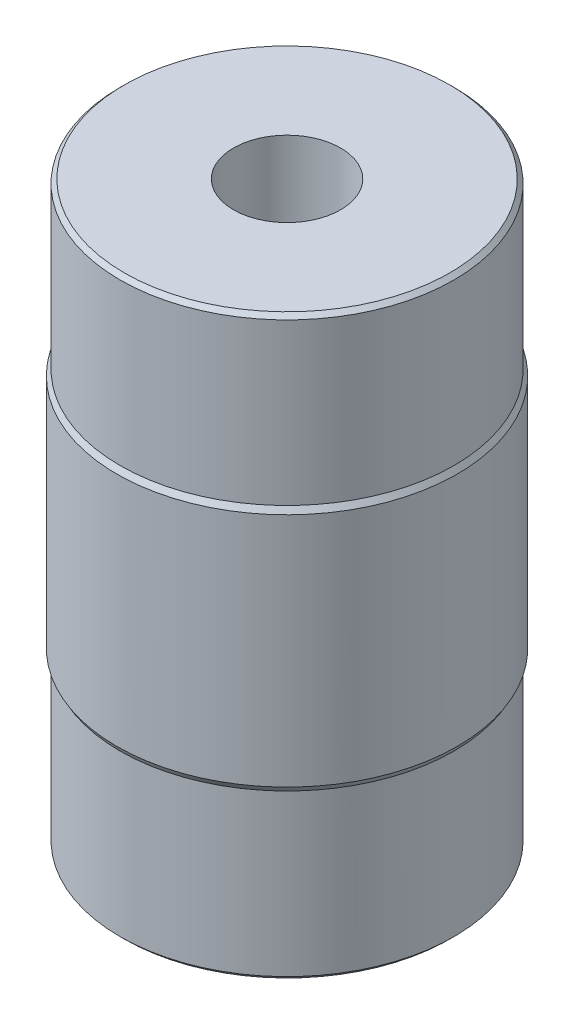
ISO-10303-21;
HEADER;
FILE_DESCRIPTION(('STEP AP214'),'2;1');
FILE_NAME('part.step','',(''),(''),'','','');
FILE_SCHEMA(('AUTOMOTIVE_DESIGN { 1 0 10303 214 1 1 1 1 }'));
ENDSEC;
DATA;
#1=APPLICATION_CONTEXT('core data for automotive mechanical design processes');
#2=APPLICATION_PROTOCOL_DEFINITION('international standard','automotive_design',2000,#1);
#3=PRODUCT_CONTEXT('',#1,'mechanical');
#4=PRODUCT('Part','Part','',(#3));
#5=PRODUCT_RELATED_PRODUCT_CATEGORY('part','',(#4));
#6=PRODUCT_DEFINITION_FORMATION('','',#4);
#7=PRODUCT_DEFINITION_CONTEXT('part definition',#1,'design');
#8=PRODUCT_DEFINITION('design','',#6,#7);
#9=PRODUCT_DEFINITION_SHAPE('','',#8);
#10=(LENGTH_UNIT() NAMED_UNIT(*) SI_UNIT(.MILLI.,.METRE.));
#11=(NAMED_UNIT(*) PLANE_ANGLE_UNIT() SI_UNIT($,.RADIAN.));
#12=(NAMED_UNIT(*) SI_UNIT($,.STERADIAN.) SOLID_ANGLE_UNIT());
#13=UNCERTAINTY_MEASURE_WITH_UNIT(LENGTH_MEASURE(1.E-05),#10,'distance_accuracy_value','');
#14=(GEOMETRIC_REPRESENTATION_CONTEXT(3) GLOBAL_UNCERTAINTY_ASSIGNED_CONTEXT((#13)) GLOBAL_UNIT_ASSIGNED_CONTEXT((#10,
#11,#12)) REPRESENTATION_CONTEXT('',''));
#15=CARTESIAN_POINT('',(0.,0.,0.));
#16=DIRECTION('',(0.,0.,1.));
#17=DIRECTION('',(1.,0.,0.));
#18=AXIS2_PLACEMENT_3D('',#15,#16,#17);
#19=CARTESIAN_POINT('',(0.,0.,0.));
#20=DIRECTION('',(0.,1.,0.));
#21=DIRECTION('',(0.,0.,1.));
#22=AXIS2_PLACEMENT_3D('',#19,#20,#21);
#23=CYLINDRICAL_SURFACE('',#22,0.65);
#24=CARTESIAN_POINT('',(0.,7.,0.));
#25=DIRECTION('',(0.,1.,0.));
#26=DIRECTION('',(0.,0.,1.));
#27=AXIS2_PLACEMENT_3D('',#24,#25,#26);
#28=CIRCLE('',#27,0.65);
#29=CARTESIAN_POINT('',(0.,7.,0.65));
#30=VERTEX_POINT('',#29);
#31=EDGE_CURVE('E46',#30,#30,#28,.F.);
#32=ORIENTED_EDGE('',*,*,#31,.F.);
#33=EDGE_LOOP('',(#32));
#34=FACE_BOUND('',#33,.T.);
#35=CARTESIAN_POINT('',(0.,0.,0.));
#36=DIRECTION('',(0.,1.,0.));
#37=DIRECTION('',(0.,0.,1.));
#38=AXIS2_PLACEMENT_3D('',#35,#36,#37);
#39=CIRCLE('',#38,0.65);
#40=CARTESIAN_POINT('',(0.,0.,0.65));
#41=VERTEX_POINT('',#40);
#42=EDGE_CURVE('E18',#41,#41,#39,.F.);
#43=ORIENTED_EDGE('',*,*,#42,.T.);
#44=EDGE_LOOP('',(#43));
#45=FACE_BOUND('',#44,.T.);
#46=ADVANCED_FACE('F15',(#34,#45),#23,.F.);
#47=CARTESIAN_POINT('',(0.,0.,0.));
#48=DIRECTION('',(0.,1.,0.));
#49=DIRECTION('',(0.,0.,1.));
#50=AXIS2_PLACEMENT_3D('',#47,#48,#49);
#51=PLANE('',#50);
#52=ORIENTED_EDGE('',*,*,#42,.F.);
#53=EDGE_LOOP('',(#52));
#54=FACE_BOUND('',#53,.T.);
#55=CARTESIAN_POINT('',(0.,5.6843418860808E-11,0.));
#56=DIRECTION('',(0.,1.,0.));
#57=DIRECTION('',(0.,0.,1.));
#58=AXIS2_PLACEMENT_3D('',#55,#56,#57);
#59=CIRCLE('',#58,1.97499999995898);
#60=CARTESIAN_POINT('',(0.,5.6843418860808E-11,1.97499999995898));
#61=VERTEX_POINT('',#60);
#62=EDGE_CURVE('E44',#61,#61,#59,.T.);
#63=ORIENTED_EDGE('',*,*,#62,.F.);
#64=EDGE_LOOP('',(#63));
#65=FACE_BOUND('',#64,.T.);
#66=ADVANCED_FACE('F54',(#54,#65),#51,.F.);
#67=CARTESIAN_POINT('',(0.,7.,0.));
#68=DIRECTION('',(0.,1.,0.));
#69=DIRECTION('',(0.,0.,1.));
#70=AXIS2_PLACEMENT_3D('',#67,#68,#69);
#71=PLANE('',#70);
#72=ORIENTED_EDGE('',*,*,#31,.T.);
#73=EDGE_LOOP('',(#72));
#74=FACE_BOUND('',#73,.T.);
#75=CARTESIAN_POINT('',(0.,7.000000000005,0.));
#76=DIRECTION('',(0.,-1.,0.));
#77=DIRECTION('',(0.,0.,-1.));
#78=AXIS2_PLACEMENT_3D('',#75,#76,#77);
#79=CIRCLE('',#78,1.97499999995898);
#80=CARTESIAN_POINT('',(0.,7.000000000005,-1.97499999995898));
#81=VERTEX_POINT('',#80);
#82=EDGE_CURVE('E41',#81,#81,#79,.T.);
#83=ORIENTED_EDGE('',*,*,#82,.F.);
#84=EDGE_LOOP('',(#83));
#85=FACE_BOUND('',#84,.T.);
#86=ADVANCED_FACE('F57',(#74,#85),#71,.T.);
#87=CARTESIAN_POINT('',(0.,0.0499999998737621,0.));
#88=DIRECTION('',(0.,1.,0.));
#89=DIRECTION('',(0.,0.,1.));
#90=AXIS2_PLACEMENT_3D('',#87,#88,#89);
#91=CONICAL_SURFACE('',#90,2.0249999997759,0.785398163397448);
#92=CARTESIAN_POINT('',(0.,0.05000000000001,0.));
#93=DIRECTION('',(0.,1.,0.));
#94=DIRECTION('',(0.,0.,1.));
#95=AXIS2_PLACEMENT_3D('',#92,#93,#94);
#96=CIRCLE('',#95,2.025);
#97=CARTESIAN_POINT('',(0.,0.05000000000001,2.025));
#98=VERTEX_POINT('',#97);
#99=EDGE_CURVE('E38',#98,#98,#96,.T.);
#100=ORIENTED_EDGE('',*,*,#99,.F.);
#101=EDGE_LOOP('',(#100));
#102=FACE_BOUND('',#101,.T.);
#103=ORIENTED_EDGE('',*,*,#62,.T.);
#104=EDGE_LOOP('',(#103));
#105=FACE_BOUND('',#104,.T.);
#106=ADVANCED_FACE('F60',(#102,#105),#91,.T.);
#107=CARTESIAN_POINT('',(0.,6.95000000001755,0.));
#108=DIRECTION('',(0.,-1.,0.));
#109=DIRECTION('',(0.,0.,-1.));
#110=AXIS2_PLACEMENT_3D('',#107,#108,#109);
#111=CONICAL_SURFACE('',#110,2.02499999988959,0.785398162829014);
#112=CARTESIAN_POINT('',(0.,6.95,0.));
#113=DIRECTION('',(0.,1.,0.));
#114=DIRECTION('',(0.,0.,1.));
#115=AXIS2_PLACEMENT_3D('',#112,#113,#114);
#116=CIRCLE('',#115,2.025);
#117=CARTESIAN_POINT('',(0.,6.95,2.025));
#118=VERTEX_POINT('',#117);
#119=EDGE_CURVE('E35',#118,#118,#116,.F.);
#120=ORIENTED_EDGE('',*,*,#119,.F.);
#121=EDGE_LOOP('',(#120));
#122=FACE_BOUND('',#121,.T.);
#123=ORIENTED_EDGE('',*,*,#82,.T.);
#124=EDGE_LOOP('',(#123));
#125=FACE_BOUND('',#124,.T.);
#126=ADVANCED_FACE('F62',(#122,#125),#111,.T.);
#127=CARTESIAN_POINT('',(0.,0.,0.));
#128=DIRECTION('',(0.,1.,0.));
#129=DIRECTION('',(0.,0.,1.));
#130=AXIS2_PLACEMENT_3D('',#127,#128,#129);
#131=CYLINDRICAL_SURFACE('',#130,2.025);
#132=CARTESIAN_POINT('',(0.,2.00000000000955,0.));
#133=DIRECTION('',(0.,1.,0.));
#134=DIRECTION('',(1.,0.,0.));
#135=AXIS2_PLACEMENT_3D('',#132,#133,#134);
#136=CIRCLE('',#135,2.02500000006012);
#137=CARTESIAN_POINT('',(2.02500000006012,2.00000000000955,0.));
#138=VERTEX_POINT('',#137);
#139=EDGE_CURVE('E32',#138,#138,#136,.T.);
#140=ORIENTED_EDGE('',*,*,#139,.F.);
#141=EDGE_LOOP('',(#140));
#142=FACE_BOUND('',#141,.T.);
#143=ORIENTED_EDGE('',*,*,#99,.T.);
#144=EDGE_LOOP('',(#143));
#145=FACE_BOUND('',#144,.T.);
#146=ADVANCED_FACE('F70',(#142,#145),#131,.T.);
#147=CARTESIAN_POINT('',(0.,0.,0.));
#148=DIRECTION('',(0.,1.,0.));
#149=DIRECTION('',(0.,0.,1.));
#150=AXIS2_PLACEMENT_3D('',#147,#148,#149);
#151=CYLINDRICAL_SURFACE('',#150,2.025);
#152=CARTESIAN_POINT('',(0.,5.0000000000523,0.));
#153=DIRECTION('',(0.,-1.,0.));
#154=DIRECTION('',(-1.,0.,0.));
#155=AXIS2_PLACEMENT_3D('',#152,#153,#154);
#156=CIRCLE('',#155,2.02500000000327);
#157=CARTESIAN_POINT('',(-2.02500000000327,5.0000000000523,0.));
#158=VERTEX_POINT('',#157);
#159=EDGE_CURVE('E27',#158,#158,#156,.T.);
#160=ORIENTED_EDGE('',*,*,#159,.F.);
#161=EDGE_LOOP('',(#160));
#162=FACE_BOUND('',#161,.T.);
#163=ORIENTED_EDGE('',*,*,#119,.T.);
#164=EDGE_LOOP('',(#163));
#165=FACE_BOUND('',#164,.T.);
#166=ADVANCED_FACE('F89',(#162,#165),#151,.T.);
#167=CARTESIAN_POINT('',(0.,2.06928203232337,0.));
#168=DIRECTION('',(0.,1.,0.));
#169=DIRECTION('',(0.,0.,1.));
#170=AXIS2_PLACEMENT_3D('',#167,#168,#169);
#171=CONICAL_SURFACE('',#170,2.06500000007281,0.523598775666574);
#172=CARTESIAN_POINT('',(0.,2.069282032303,0.));
#173=DIRECTION('',(0.,-1.,0.));
#174=DIRECTION('',(0.,0.,-1.));
#175=AXIS2_PLACEMENT_3D('',#172,#173,#174);
#176=CIRCLE('',#175,2.065);
#177=CARTESIAN_POINT('',(0.,2.069282032303,-2.065));
#178=VERTEX_POINT('',#177);
#179=EDGE_CURVE('E22',#178,#178,#176,.F.);
#180=ORIENTED_EDGE('',*,*,#179,.F.);
#181=EDGE_LOOP('',(#180));
#182=FACE_BOUND('',#181,.T.);
#183=ORIENTED_EDGE('',*,*,#139,.T.);
#184=EDGE_LOOP('',(#183));
#185=FACE_BOUND('',#184,.T.);
#186=ADVANCED_FACE('F82',(#182,#185),#171,.T.);
#187=CARTESIAN_POINT('',(0.,4.93071796768163,0.));
#188=DIRECTION('',(0.,-1.,0.));
#189=DIRECTION('',(0.,0.,-1.));
#190=AXIS2_PLACEMENT_3D('',#187,#188,#189);
#191=CONICAL_SURFACE('',#190,2.06500000001597,0.523598775311303);
#192=CARTESIAN_POINT('',(0.,4.930717967697,0.));
#193=DIRECTION('',(0.,-1.,0.));
#194=DIRECTION('',(0.,0.,-1.));
#195=AXIS2_PLACEMENT_3D('',#192,#193,#194);
#196=CIRCLE('',#195,2.065);
#197=CARTESIAN_POINT('',(0.,4.930717967697,-2.065));
#198=VERTEX_POINT('',#197);
#199=EDGE_CURVE('E10',#198,#198,#196,.T.);
#200=ORIENTED_EDGE('',*,*,#199,.F.);
#201=EDGE_LOOP('',(#200));
#202=FACE_BOUND('',#201,.T.);
#203=ORIENTED_EDGE('',*,*,#159,.T.);
#204=EDGE_LOOP('',(#203));
#205=FACE_BOUND('',#204,.T.);
#206=ADVANCED_FACE('F77',(#202,#205),#191,.T.);
#207=CARTESIAN_POINT('',(0.,5.15,0.));
#208=DIRECTION('',(0.,-1.,0.));
#209=DIRECTION('',(0.,0.,-1.));
#210=AXIS2_PLACEMENT_3D('',#207,#208,#209);
#211=CYLINDRICAL_SURFACE('',#210,2.065);
#212=ORIENTED_EDGE('',*,*,#199,.T.);
#213=EDGE_LOOP('',(#212));
#214=FACE_BOUND('',#213,.T.);
#215=ORIENTED_EDGE('',*,*,#179,.T.);
#216=EDGE_LOOP('',(#215));
#217=FACE_BOUND('',#216,.T.);
#218=ADVANCED_FACE('F75',(#214,#217),#211,.T.);
#219=CLOSED_SHELL('',(#46,#66,#86,#106,#126,#146,#166,#186,#206,#218));
#220=MANIFOLD_SOLID_BREP('B1',#219);
#221=ADVANCED_BREP_SHAPE_REPRESENTATION('',(#18,#220),#14);
#222=SHAPE_DEFINITION_REPRESENTATION(#9,#221);
ENDSEC;
END-ISO-10303-21;
